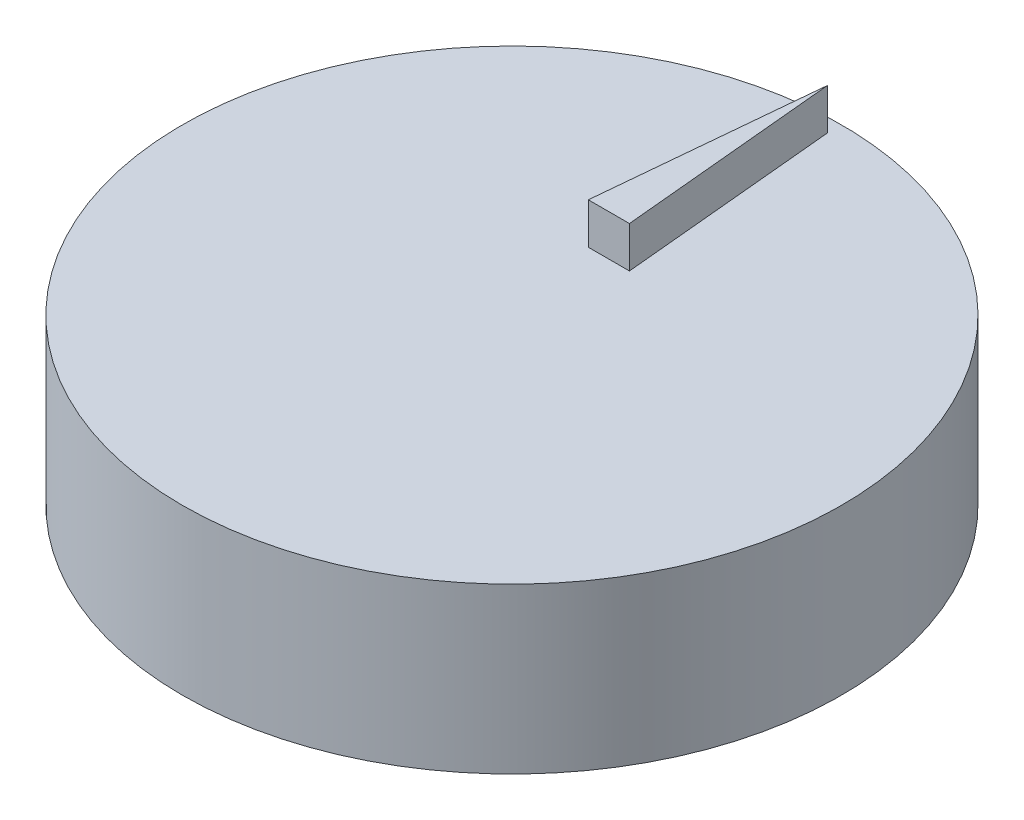
ISO-10303-21;
HEADER;
FILE_DESCRIPTION(('STEP AP214'),'2;1');
FILE_NAME('part.step','',(''),(''),'','','');
FILE_SCHEMA(('AUTOMOTIVE_DESIGN { 1 0 10303 214 1 1 1 1 }'));
ENDSEC;
DATA;
#1=APPLICATION_CONTEXT('core data for automotive mechanical design processes');
#2=APPLICATION_PROTOCOL_DEFINITION('international standard','automotive_design',2000,#1);
#3=PRODUCT_CONTEXT('',#1,'mechanical');
#4=PRODUCT('Part','Part','',(#3));
#5=PRODUCT_RELATED_PRODUCT_CATEGORY('part','',(#4));
#6=PRODUCT_DEFINITION_FORMATION('','',#4);
#7=PRODUCT_DEFINITION_CONTEXT('part definition',#1,'design');
#8=PRODUCT_DEFINITION('design','',#6,#7);
#9=PRODUCT_DEFINITION_SHAPE('','',#8);
#10=(LENGTH_UNIT() NAMED_UNIT(*) SI_UNIT(.MILLI.,.METRE.));
#11=(NAMED_UNIT(*) PLANE_ANGLE_UNIT() SI_UNIT($,.RADIAN.));
#12=(NAMED_UNIT(*) SI_UNIT($,.STERADIAN.) SOLID_ANGLE_UNIT());
#13=UNCERTAINTY_MEASURE_WITH_UNIT(LENGTH_MEASURE(1.E-05),#10,'distance_accuracy_value','');
#14=(GEOMETRIC_REPRESENTATION_CONTEXT(3) GLOBAL_UNCERTAINTY_ASSIGNED_CONTEXT((#13)) GLOBAL_UNIT_ASSIGNED_CONTEXT((#10,
#11,#12)) REPRESENTATION_CONTEXT('',''));
#15=CARTESIAN_POINT('',(0.,0.,0.));
#16=DIRECTION('',(0.,0.,1.));
#17=DIRECTION('',(1.,0.,0.));
#18=AXIS2_PLACEMENT_3D('',#15,#16,#17);
#19=CARTESIAN_POINT('',(0.,20.,-15.));
#20=DIRECTION('',(0.,1.,0.));
#21=DIRECTION('',(0.,0.,1.));
#22=AXIS2_PLACEMENT_3D('',#19,#20,#21);
#23=PLANE('',#22);
#24=CARTESIAN_POINT('',(0.,20.,-15.));
#25=DIRECTION('',(0.,1.,0.));
#26=DIRECTION('',(0.,0.,1.));
#27=AXIS2_PLACEMENT_3D('',#24,#25,#26);
#28=CIRCLE('',#27,40.0812411098952);
#29=CARTESIAN_POINT('',(0.,20.,25.0812411098952));
#30=VERTEX_POINT('',#29);
#31=EDGE_CURVE('E11',#30,#30,#28,.T.);
#32=ORIENTED_EDGE('',*,*,#31,.T.);
#33=EDGE_LOOP('',(#32));
#34=FACE_BOUND('',#33,.T.);
#35=DIRECTION('',(-0.093652210466227,0.,0.995604973608906));
#36=VECTOR('',#35,1.);
#37=CARTESIAN_POINT('',(0.,20.,-53.3674333416405));
#38=LINE('',#37,#36);
#39=CARTESIAN_POINT('',(0.,20.,-53.3674333416405));
#40=VERTEX_POINT('',#39);
#41=CARTESIAN_POINT('',(-2.5,20.,-26.7902450229531));
#42=VERTEX_POINT('',#41);
#43=EDGE_CURVE('E632',#40,#42,#38,.T.);
#44=ORIENTED_EDGE('',*,*,#43,.F.);
#45=DIRECTION('',(-0.0936522104662273,0.,-0.995604973608906));
#46=VECTOR('',#45,1.);
#47=CARTESIAN_POINT('',(2.5,20.,-26.7902450229531));
#48=LINE('',#47,#46);
#49=CARTESIAN_POINT('',(2.5,20.,-26.7902450229531));
#50=VERTEX_POINT('',#49);
#51=EDGE_CURVE('E232',#50,#40,#48,.T.);
#52=ORIENTED_EDGE('',*,*,#51,.F.);
#53=DIRECTION('',(1.,0.,0.));
#54=VECTOR('',#53,1.);
#55=CARTESIAN_POINT('',(-2.5,20.,-26.7902450229531));
#56=LINE('',#55,#54);
#57=EDGE_CURVE('E228',#42,#50,#56,.T.);
#58=ORIENTED_EDGE('',*,*,#57,.F.);
#59=EDGE_LOOP('',(#44,#52,#58));
#60=FACE_BOUND('',#59,.T.);
#61=ADVANCED_FACE('F33',(#34,#60),#23,.T.);
#62=CARTESIAN_POINT('',(0.,0.,-15.));
#63=DIRECTION('',(0.,1.,0.));
#64=DIRECTION('',(0.,0.,1.));
#65=AXIS2_PLACEMENT_3D('',#62,#63,#64);
#66=PLANE('',#65);
#67=DIRECTION('',(0.,0.,1.));
#68=VECTOR('',#67,1.);
#69=CARTESIAN_POINT('',(-2.5000000000001,0.,-18.));
#70=LINE('',#69,#68);
#71=CARTESIAN_POINT('',(-2.5000000000001,0.,-18.));
#72=VERTEX_POINT('',#71);
#73=CARTESIAN_POINT('',(-2.5000000000001,0.,-15.));
#74=VERTEX_POINT('',#73);
#75=EDGE_CURVE('E266',#72,#74,#70,.T.);
#76=ORIENTED_EDGE('',*,*,#75,.T.);
#77=DIRECTION('',(1.,0.,0.));
#78=VECTOR('',#77,1.);
#79=CARTESIAN_POINT('',(-2.5000000000001,0.,-15.));
#80=LINE('',#79,#78);
#81=CARTESIAN_POINT('',(2.4999999999999,0.,-15.));
#82=VERTEX_POINT('',#81);
#83=EDGE_CURVE('E280',#74,#82,#80,.T.);
#84=ORIENTED_EDGE('',*,*,#83,.T.);
#85=DIRECTION('',(0.,0.,-1.));
#86=VECTOR('',#85,1.);
#87=CARTESIAN_POINT('',(2.4999999999999,0.,-18.));
#88=LINE('',#87,#86);
#89=CARTESIAN_POINT('',(2.4999999999999,0.,-18.));
#90=VERTEX_POINT('',#89);
#91=EDGE_CURVE('E283',#82,#90,#88,.T.);
#92=ORIENTED_EDGE('',*,*,#91,.T.);
#93=DIRECTION('',(-1.,0.,0.));
#94=VECTOR('',#93,1.);
#95=CARTESIAN_POINT('',(-2.5000000000001,0.,-18.));
#96=LINE('',#95,#94);
#97=EDGE_CURVE('E271',#90,#72,#96,.T.);
#98=ORIENTED_EDGE('',*,*,#97,.T.);
#99=EDGE_LOOP('',(#76,#84,#92,#98));
#100=FACE_BOUND('',#99,.T.);
#101=DIRECTION('',(0.,0.,1.));
#102=VECTOR('',#101,1.);
#103=CARTESIAN_POINT('',(-2.50000000000005,0.,-4.));
#104=LINE('',#103,#102);
#105=CARTESIAN_POINT('',(-2.50000000000005,0.,-4.));
#106=VERTEX_POINT('',#105);
#107=CARTESIAN_POINT('',(-2.50000000000005,0.,-0.999999999999999));
#108=VERTEX_POINT('',#107);
#109=EDGE_CURVE('E328',#106,#108,#104,.T.);
#110=ORIENTED_EDGE('',*,*,#109,.T.);
#111=DIRECTION('',(1.,0.,0.));
#112=VECTOR('',#111,1.);
#113=CARTESIAN_POINT('',(-2.50000000000005,0.,-0.999999999999999));
#114=LINE('',#113,#112);
#115=CARTESIAN_POINT('',(2.49999999999995,0.,-0.999999999999999));
#116=VERTEX_POINT('',#115);
#117=EDGE_CURVE('E342',#108,#116,#114,.T.);
#118=ORIENTED_EDGE('',*,*,#117,.T.);
#119=DIRECTION('',(0.,0.,-1.));
#120=VECTOR('',#119,1.);
#121=CARTESIAN_POINT('',(2.49999999999995,0.,-4.));
#122=LINE('',#121,#120);
#123=CARTESIAN_POINT('',(2.49999999999995,0.,-4.));
#124=VERTEX_POINT('',#123);
#125=EDGE_CURVE('E345',#116,#124,#122,.T.);
#126=ORIENTED_EDGE('',*,*,#125,.T.);
#127=DIRECTION('',(-1.,0.,0.));
#128=VECTOR('',#127,1.);
#129=CARTESIAN_POINT('',(-2.50000000000005,0.,-4.));
#130=LINE('',#129,#128);
#131=EDGE_CURVE('E333',#124,#106,#130,.T.);
#132=ORIENTED_EDGE('',*,*,#131,.T.);
#133=EDGE_LOOP('',(#110,#118,#126,#132));
#134=FACE_BOUND('',#133,.T.);
#135=DIRECTION('',(0.,0.,1.));
#136=VECTOR('',#135,1.);
#137=CARTESIAN_POINT('',(-2.5,0.,10.));
#138=LINE('',#137,#136);
#139=CARTESIAN_POINT('',(-2.5,0.,10.));
#140=VERTEX_POINT('',#139);
#141=CARTESIAN_POINT('',(-2.5,0.,13.));
#142=VERTEX_POINT('',#141);
#143=EDGE_CURVE('E390',#140,#142,#138,.T.);
#144=ORIENTED_EDGE('',*,*,#143,.T.);
#145=DIRECTION('',(1.,0.,0.));
#146=VECTOR('',#145,1.);
#147=CARTESIAN_POINT('',(-2.5,0.,13.));
#148=LINE('',#147,#146);
#149=CARTESIAN_POINT('',(2.5,0.,13.));
#150=VERTEX_POINT('',#149);
#151=EDGE_CURVE('E404',#142,#150,#148,.T.);
#152=ORIENTED_EDGE('',*,*,#151,.T.);
#153=DIRECTION('',(0.,0.,-1.));
#154=VECTOR('',#153,1.);
#155=CARTESIAN_POINT('',(2.5,0.,10.));
#156=LINE('',#155,#154);
#157=CARTESIAN_POINT('',(2.5,0.,10.));
#158=VERTEX_POINT('',#157);
#159=EDGE_CURVE('E407',#150,#158,#156,.T.);
#160=ORIENTED_EDGE('',*,*,#159,.T.);
#161=DIRECTION('',(-1.,0.,0.));
#162=VECTOR('',#161,1.);
#163=CARTESIAN_POINT('',(-2.5,0.,10.));
#164=LINE('',#163,#162);
#165=EDGE_CURVE('E395',#158,#140,#164,.T.);
#166=ORIENTED_EDGE('',*,*,#165,.T.);
#167=EDGE_LOOP('',(#144,#152,#160,#166));
#168=FACE_BOUND('',#167,.T.);
#169=CARTESIAN_POINT('',(0.,0.,-15.));
#170=DIRECTION('',(0.,1.,0.));
#171=DIRECTION('',(0.,0.,1.));
#172=AXIS2_PLACEMENT_3D('',#169,#170,#171);
#173=CIRCLE('',#172,40.0812411098952);
#174=CARTESIAN_POINT('',(0.,0.,25.0812411098952));
#175=VERTEX_POINT('',#174);
#176=EDGE_CURVE('E37',#175,#175,#173,.T.);
#177=ORIENTED_EDGE('',*,*,#176,.F.);
#178=EDGE_LOOP('',(#177));
#179=FACE_BOUND('',#178,.T.);
#180=DIRECTION('',(0.,0.,1.));
#181=VECTOR('',#180,1.);
#182=CARTESIAN_POINT('',(-2.50000000000002,0.,3.));
#183=LINE('',#182,#181);
#184=CARTESIAN_POINT('',(-2.50000000000002,0.,3.));
#185=VERTEX_POINT('',#184);
#186=CARTESIAN_POINT('',(-2.50000000000002,0.,6.));
#187=VERTEX_POINT('',#186);
#188=EDGE_CURVE('E359',#185,#187,#183,.T.);
#189=ORIENTED_EDGE('',*,*,#188,.T.);
#190=DIRECTION('',(1.,0.,0.));
#191=VECTOR('',#190,1.);
#192=CARTESIAN_POINT('',(-2.50000000000002,0.,6.));
#193=LINE('',#192,#191);
#194=CARTESIAN_POINT('',(2.49999999999998,0.,6.));
#195=VERTEX_POINT('',#194);
#196=EDGE_CURVE('E373',#187,#195,#193,.T.);
#197=ORIENTED_EDGE('',*,*,#196,.T.);
#198=DIRECTION('',(0.,0.,-1.));
#199=VECTOR('',#198,1.);
#200=CARTESIAN_POINT('',(2.49999999999998,0.,3.));
#201=LINE('',#200,#199);
#202=CARTESIAN_POINT('',(2.49999999999998,0.,3.));
#203=VERTEX_POINT('',#202);
#204=EDGE_CURVE('E376',#195,#203,#201,.T.);
#205=ORIENTED_EDGE('',*,*,#204,.T.);
#206=DIRECTION('',(-1.,0.,0.));
#207=VECTOR('',#206,1.);
#208=CARTESIAN_POINT('',(-2.50000000000002,0.,3.));
#209=LINE('',#208,#207);
#210=EDGE_CURVE('E364',#203,#185,#209,.T.);
#211=ORIENTED_EDGE('',*,*,#210,.T.);
#212=EDGE_LOOP('',(#189,#197,#205,#211));
#213=FACE_BOUND('',#212,.T.);
#214=DIRECTION('',(0.,0.,1.));
#215=VECTOR('',#214,1.);
#216=CARTESIAN_POINT('',(-2.50000000000007,0.,-11.));
#217=LINE('',#216,#215);
#218=CARTESIAN_POINT('',(-2.50000000000007,0.,-11.));
#219=VERTEX_POINT('',#218);
#220=CARTESIAN_POINT('',(-2.50000000000007,0.,-8.));
#221=VERTEX_POINT('',#220);
#222=EDGE_CURVE('E297',#219,#221,#217,.T.);
#223=ORIENTED_EDGE('',*,*,#222,.T.);
#224=DIRECTION('',(1.,0.,0.));
#225=VECTOR('',#224,1.);
#226=CARTESIAN_POINT('',(-2.50000000000007,0.,-8.));
#227=LINE('',#226,#225);
#228=CARTESIAN_POINT('',(2.49999999999993,0.,-8.));
#229=VERTEX_POINT('',#228);
#230=EDGE_CURVE('E311',#221,#229,#227,.T.);
#231=ORIENTED_EDGE('',*,*,#230,.T.);
#232=DIRECTION('',(0.,0.,-1.));
#233=VECTOR('',#232,1.);
#234=CARTESIAN_POINT('',(2.49999999999993,0.,-11.));
#235=LINE('',#234,#233);
#236=CARTESIAN_POINT('',(2.49999999999993,0.,-11.));
#237=VERTEX_POINT('',#236);
#238=EDGE_CURVE('E314',#229,#237,#235,.T.);
#239=ORIENTED_EDGE('',*,*,#238,.T.);
#240=DIRECTION('',(-1.,0.,0.));
#241=VECTOR('',#240,1.);
#242=CARTESIAN_POINT('',(-2.50000000000007,0.,-11.));
#243=LINE('',#242,#241);
#244=EDGE_CURVE('E302',#237,#219,#243,.T.);
#245=ORIENTED_EDGE('',*,*,#244,.T.);
#246=EDGE_LOOP('',(#223,#231,#239,#245));
#247=FACE_BOUND('',#246,.T.);
#248=DIRECTION('',(0.,0.,1.));
#249=VECTOR('',#248,1.);
#250=CARTESIAN_POINT('',(-2.50000000000012,0.,-25.));
#251=LINE('',#250,#249);
#252=CARTESIAN_POINT('',(-2.50000000000012,0.,-25.));
#253=VERTEX_POINT('',#252);
#254=CARTESIAN_POINT('',(-2.50000000000012,0.,-22.));
#255=VERTEX_POINT('',#254);
#256=EDGE_CURVE('E56',#253,#255,#251,.T.);
#257=ORIENTED_EDGE('',*,*,#256,.T.);
#258=DIRECTION('',(1.,0.,0.));
#259=VECTOR('',#258,1.);
#260=CARTESIAN_POINT('',(-2.50000000000012,0.,-22.));
#261=LINE('',#260,#259);
#262=CARTESIAN_POINT('',(2.49999999999988,0.,-22.));
#263=VERTEX_POINT('',#262);
#264=EDGE_CURVE('E235',#255,#263,#261,.T.);
#265=ORIENTED_EDGE('',*,*,#264,.T.);
#266=DIRECTION('',(0.,0.,-1.));
#267=VECTOR('',#266,1.);
#268=CARTESIAN_POINT('',(2.49999999999988,0.,-25.));
#269=LINE('',#268,#267);
#270=CARTESIAN_POINT('',(2.49999999999988,0.,-25.));
#271=VERTEX_POINT('',#270);
#272=EDGE_CURVE('E254',#263,#271,#269,.T.);
#273=ORIENTED_EDGE('',*,*,#272,.T.);
#274=DIRECTION('',(-1.,0.,0.));
#275=VECTOR('',#274,1.);
#276=CARTESIAN_POINT('',(-2.50000000000012,0.,-25.));
#277=LINE('',#276,#275);
#278=EDGE_CURVE('E245',#271,#253,#277,.T.);
#279=ORIENTED_EDGE('',*,*,#278,.T.);
#280=EDGE_LOOP('',(#257,#265,#273,#279));
#281=FACE_BOUND('',#280,.T.);
#282=ADVANCED_FACE('F426',(#100,#134,#168,#179,#213,#247,#281),#66,.F.);
#283=CARTESIAN_POINT('',(0.,20.,-15.));
#284=DIRECTION('',(0.,-1.,0.));
#285=DIRECTION('',(0.,0.,-1.));
#286=AXIS2_PLACEMENT_3D('',#283,#284,#285);
#287=CYLINDRICAL_SURFACE('',#286,40.0812411098952);
#288=ORIENTED_EDGE('',*,*,#31,.F.);
#289=EDGE_LOOP('',(#288));
#290=FACE_BOUND('',#289,.T.);
#291=ORIENTED_EDGE('',*,*,#176,.T.);
#292=EDGE_LOOP('',(#291));
#293=FACE_BOUND('',#292,.T.);
#294=ADVANCED_FACE('F35',(#290,#293),#287,.T.);
#295=CARTESIAN_POINT('',(-2.5,8.,10.));
#296=DIRECTION('',(1.,0.,0.));
#297=DIRECTION('',(0.,0.,-1.));
#298=AXIS2_PLACEMENT_3D('',#295,#296,#297);
#299=PLANE('',#298);
#300=ORIENTED_EDGE('',*,*,#143,.F.);
#301=DIRECTION('',(0.,-1.,0.));
#302=VECTOR('',#301,1.);
#303=CARTESIAN_POINT('',(-2.5,8.,10.));
#304=LINE('',#303,#302);
#305=CARTESIAN_POINT('',(-2.5,8.,10.));
#306=VERTEX_POINT('',#305);
#307=EDGE_CURVE('E401',#306,#140,#304,.T.);
#308=ORIENTED_EDGE('',*,*,#307,.F.);
#309=DIRECTION('',(0.,0.,1.));
#310=VECTOR('',#309,1.);
#311=CARTESIAN_POINT('',(-2.5,8.,10.));
#312=LINE('',#311,#310);
#313=CARTESIAN_POINT('',(-2.5,8.,13.));
#314=VERTEX_POINT('',#313);
#315=EDGE_CURVE('E391',#306,#314,#312,.T.);
#316=ORIENTED_EDGE('',*,*,#315,.T.);
#317=DIRECTION('',(0.,-1.,0.));
#318=VECTOR('',#317,1.);
#319=CARTESIAN_POINT('',(-2.5,8.,13.));
#320=LINE('',#319,#318);
#321=EDGE_CURVE('E418',#314,#142,#320,.T.);
#322=ORIENTED_EDGE('',*,*,#321,.T.);
#323=EDGE_LOOP('',(#300,#308,#316,#322));
#324=FACE_BOUND('',#323,.T.);
#325=ADVANCED_FACE('F464',(#324),#299,.T.);
#326=CARTESIAN_POINT('',(-2.5,8.,13.));
#327=DIRECTION('',(0.,0.,-1.));
#328=DIRECTION('',(-1.,0.,0.));
#329=AXIS2_PLACEMENT_3D('',#326,#327,#328);
#330=PLANE('',#329);
#331=ORIENTED_EDGE('',*,*,#151,.F.);
#332=ORIENTED_EDGE('',*,*,#321,.F.);
#333=DIRECTION('',(1.,0.,0.));
#334=VECTOR('',#333,1.);
#335=CARTESIAN_POINT('',(-2.5,8.,13.));
#336=LINE('',#335,#334);
#337=CARTESIAN_POINT('',(2.5,8.,13.));
#338=VERTEX_POINT('',#337);
#339=EDGE_CURVE('E394',#314,#338,#336,.T.);
#340=ORIENTED_EDGE('',*,*,#339,.T.);
#341=DIRECTION('',(0.,-1.,0.));
#342=VECTOR('',#341,1.);
#343=CARTESIAN_POINT('',(2.5,8.,13.));
#344=LINE('',#343,#342);
#345=EDGE_CURVE('E416',#338,#150,#344,.T.);
#346=ORIENTED_EDGE('',*,*,#345,.T.);
#347=EDGE_LOOP('',(#331,#332,#340,#346));
#348=FACE_BOUND('',#347,.T.);
#349=ADVANCED_FACE('F467',(#348),#330,.T.);
#350=CARTESIAN_POINT('',(2.5,8.,10.));
#351=DIRECTION('',(-1.,0.,0.));
#352=DIRECTION('',(0.,0.,1.));
#353=AXIS2_PLACEMENT_3D('',#350,#351,#352);
#354=PLANE('',#353);
#355=ORIENTED_EDGE('',*,*,#159,.F.);
#356=ORIENTED_EDGE('',*,*,#345,.F.);
#357=DIRECTION('',(0.,0.,-1.));
#358=VECTOR('',#357,1.);
#359=CARTESIAN_POINT('',(2.5,8.,10.));
#360=LINE('',#359,#358);
#361=CARTESIAN_POINT('',(2.5,8.,10.));
#362=VERTEX_POINT('',#361);
#363=EDGE_CURVE('E397',#338,#362,#360,.T.);
#364=ORIENTED_EDGE('',*,*,#363,.T.);
#365=DIRECTION('',(0.,-1.,0.));
#366=VECTOR('',#365,1.);
#367=CARTESIAN_POINT('',(2.5,8.,10.));
#368=LINE('',#367,#366);
#369=EDGE_CURVE('E414',#362,#158,#368,.T.);
#370=ORIENTED_EDGE('',*,*,#369,.T.);
#371=EDGE_LOOP('',(#355,#356,#364,#370));
#372=FACE_BOUND('',#371,.T.);
#373=ADVANCED_FACE('F470',(#372),#354,.T.);
#374=CARTESIAN_POINT('',(-2.5,8.,10.));
#375=DIRECTION('',(0.,0.,1.));
#376=DIRECTION('',(1.,0.,0.));
#377=AXIS2_PLACEMENT_3D('',#374,#375,#376);
#378=PLANE('',#377);
#379=ORIENTED_EDGE('',*,*,#165,.F.);
#380=ORIENTED_EDGE('',*,*,#369,.F.);
#381=DIRECTION('',(-1.,0.,0.));
#382=VECTOR('',#381,1.);
#383=CARTESIAN_POINT('',(-2.5,8.,10.));
#384=LINE('',#383,#382);
#385=EDGE_CURVE('E399',#362,#306,#384,.T.);
#386=ORIENTED_EDGE('',*,*,#385,.T.);
#387=ORIENTED_EDGE('',*,*,#307,.T.);
#388=EDGE_LOOP('',(#379,#380,#386,#387));
#389=FACE_BOUND('',#388,.T.);
#390=ADVANCED_FACE('F474',(#389),#378,.T.);
#391=CARTESIAN_POINT('',(0.,8.,0.));
#392=DIRECTION('',(0.,1.,0.));
#393=DIRECTION('',(0.,0.,1.));
#394=AXIS2_PLACEMENT_3D('',#391,#392,#393);
#395=PLANE('',#394);
#396=ORIENTED_EDGE('',*,*,#315,.F.);
#397=ORIENTED_EDGE('',*,*,#385,.F.);
#398=ORIENTED_EDGE('',*,*,#363,.F.);
#399=ORIENTED_EDGE('',*,*,#339,.F.);
#400=EDGE_LOOP('',(#396,#397,#398,#399));
#401=FACE_BOUND('',#400,.T.);
#402=ADVANCED_FACE('F478',(#401),#395,.F.);
#403=CARTESIAN_POINT('',(-2.50000000000002,8.,3.));
#404=DIRECTION('',(1.,0.,0.));
#405=DIRECTION('',(0.,0.,-1.));
#406=AXIS2_PLACEMENT_3D('',#403,#404,#405);
#407=PLANE('',#406);
#408=ORIENTED_EDGE('',*,*,#188,.F.);
#409=DIRECTION('',(0.,-1.,0.));
#410=VECTOR('',#409,1.);
#411=CARTESIAN_POINT('',(-2.50000000000002,8.,3.));
#412=LINE('',#411,#410);
#413=CARTESIAN_POINT('',(-2.50000000000002,8.,3.));
#414=VERTEX_POINT('',#413);
#415=EDGE_CURVE('E370',#414,#185,#412,.T.);
#416=ORIENTED_EDGE('',*,*,#415,.F.);
#417=DIRECTION('',(0.,0.,1.));
#418=VECTOR('',#417,1.);
#419=CARTESIAN_POINT('',(-2.50000000000002,8.,3.));
#420=LINE('',#419,#418);
#421=CARTESIAN_POINT('',(-2.50000000000002,8.,6.));
#422=VERTEX_POINT('',#421);
#423=EDGE_CURVE('E360',#414,#422,#420,.T.);
#424=ORIENTED_EDGE('',*,*,#423,.T.);
#425=DIRECTION('',(0.,-1.,0.));
#426=VECTOR('',#425,1.);
#427=CARTESIAN_POINT('',(-2.50000000000002,8.,6.));
#428=LINE('',#427,#426);
#429=EDGE_CURVE('E387',#422,#187,#428,.T.);
#430=ORIENTED_EDGE('',*,*,#429,.T.);
#431=EDGE_LOOP('',(#408,#416,#424,#430));
#432=FACE_BOUND('',#431,.T.);
#433=ADVANCED_FACE('F482',(#432),#407,.T.);
#434=CARTESIAN_POINT('',(-2.50000000000002,8.,6.));
#435=DIRECTION('',(0.,0.,-1.));
#436=DIRECTION('',(-1.,0.,0.));
#437=AXIS2_PLACEMENT_3D('',#434,#435,#436);
#438=PLANE('',#437);
#439=ORIENTED_EDGE('',*,*,#196,.F.);
#440=ORIENTED_EDGE('',*,*,#429,.F.);
#441=DIRECTION('',(1.,0.,0.));
#442=VECTOR('',#441,1.);
#443=CARTESIAN_POINT('',(-2.50000000000002,8.,6.));
#444=LINE('',#443,#442);
#445=CARTESIAN_POINT('',(2.49999999999998,8.,6.));
#446=VERTEX_POINT('',#445);
#447=EDGE_CURVE('E363',#422,#446,#444,.T.);
#448=ORIENTED_EDGE('',*,*,#447,.T.);
#449=DIRECTION('',(0.,-1.,0.));
#450=VECTOR('',#449,1.);
#451=CARTESIAN_POINT('',(2.49999999999998,8.,6.));
#452=LINE('',#451,#450);
#453=EDGE_CURVE('E385',#446,#195,#452,.T.);
#454=ORIENTED_EDGE('',*,*,#453,.T.);
#455=EDGE_LOOP('',(#439,#440,#448,#454));
#456=FACE_BOUND('',#455,.T.);
#457=ADVANCED_FACE('F486',(#456),#438,.T.);
#458=CARTESIAN_POINT('',(2.49999999999998,8.,3.));
#459=DIRECTION('',(-1.,0.,0.));
#460=DIRECTION('',(0.,0.,1.));
#461=AXIS2_PLACEMENT_3D('',#458,#459,#460);
#462=PLANE('',#461);
#463=ORIENTED_EDGE('',*,*,#204,.F.);
#464=ORIENTED_EDGE('',*,*,#453,.F.);
#465=DIRECTION('',(0.,0.,-1.));
#466=VECTOR('',#465,1.);
#467=CARTESIAN_POINT('',(2.49999999999998,8.,3.));
#468=LINE('',#467,#466);
#469=CARTESIAN_POINT('',(2.49999999999998,8.,3.));
#470=VERTEX_POINT('',#469);
#471=EDGE_CURVE('E366',#446,#470,#468,.T.);
#472=ORIENTED_EDGE('',*,*,#471,.T.);
#473=DIRECTION('',(0.,-1.,0.));
#474=VECTOR('',#473,1.);
#475=CARTESIAN_POINT('',(2.49999999999998,8.,3.));
#476=LINE('',#475,#474);
#477=EDGE_CURVE('E383',#470,#203,#476,.T.);
#478=ORIENTED_EDGE('',*,*,#477,.T.);
#479=EDGE_LOOP('',(#463,#464,#472,#478));
#480=FACE_BOUND('',#479,.T.);
#481=ADVANCED_FACE('F490',(#480),#462,.T.);
#482=CARTESIAN_POINT('',(-2.50000000000002,8.,3.));
#483=DIRECTION('',(0.,0.,1.));
#484=DIRECTION('',(1.,0.,0.));
#485=AXIS2_PLACEMENT_3D('',#482,#483,#484);
#486=PLANE('',#485);
#487=ORIENTED_EDGE('',*,*,#210,.F.);
#488=ORIENTED_EDGE('',*,*,#477,.F.);
#489=DIRECTION('',(-1.,0.,0.));
#490=VECTOR('',#489,1.);
#491=CARTESIAN_POINT('',(-2.50000000000002,8.,3.));
#492=LINE('',#491,#490);
#493=EDGE_CURVE('E368',#470,#414,#492,.T.);
#494=ORIENTED_EDGE('',*,*,#493,.T.);
#495=ORIENTED_EDGE('',*,*,#415,.T.);
#496=EDGE_LOOP('',(#487,#488,#494,#495));
#497=FACE_BOUND('',#496,.T.);
#498=ADVANCED_FACE('F494',(#497),#486,.T.);
#499=CARTESIAN_POINT('',(0.,8.,0.));
#500=DIRECTION('',(0.,1.,0.));
#501=DIRECTION('',(0.,0.,1.));
#502=AXIS2_PLACEMENT_3D('',#499,#500,#501);
#503=PLANE('',#502);
#504=ORIENTED_EDGE('',*,*,#423,.F.);
#505=ORIENTED_EDGE('',*,*,#493,.F.);
#506=ORIENTED_EDGE('',*,*,#471,.F.);
#507=ORIENTED_EDGE('',*,*,#447,.F.);
#508=EDGE_LOOP('',(#504,#505,#506,#507));
#509=FACE_BOUND('',#508,.T.);
#510=ADVANCED_FACE('F498',(#509),#503,.F.);
#511=CARTESIAN_POINT('',(-2.50000000000005,8.,-4.));
#512=DIRECTION('',(1.,0.,0.));
#513=DIRECTION('',(0.,0.,-1.));
#514=AXIS2_PLACEMENT_3D('',#511,#512,#513);
#515=PLANE('',#514);
#516=ORIENTED_EDGE('',*,*,#109,.F.);
#517=DIRECTION('',(0.,-1.,0.));
#518=VECTOR('',#517,1.);
#519=CARTESIAN_POINT('',(-2.50000000000005,8.,-4.));
#520=LINE('',#519,#518);
#521=CARTESIAN_POINT('',(-2.50000000000005,8.,-4.));
#522=VERTEX_POINT('',#521);
#523=EDGE_CURVE('E339',#522,#106,#520,.T.);
#524=ORIENTED_EDGE('',*,*,#523,.F.);
#525=DIRECTION('',(0.,0.,1.));
#526=VECTOR('',#525,1.);
#527=CARTESIAN_POINT('',(-2.50000000000005,8.,-4.));
#528=LINE('',#527,#526);
#529=CARTESIAN_POINT('',(-2.50000000000005,8.,-0.999999999999999));
#530=VERTEX_POINT('',#529);
#531=EDGE_CURVE('E329',#522,#530,#528,.T.);
#532=ORIENTED_EDGE('',*,*,#531,.T.);
#533=DIRECTION('',(0.,-1.,0.));
#534=VECTOR('',#533,1.);
#535=CARTESIAN_POINT('',(-2.50000000000005,8.,-0.999999999999999));
#536=LINE('',#535,#534);
#537=EDGE_CURVE('E356',#530,#108,#536,.T.);
#538=ORIENTED_EDGE('',*,*,#537,.T.);
#539=EDGE_LOOP('',(#516,#524,#532,#538));
#540=FACE_BOUND('',#539,.T.);
#541=ADVANCED_FACE('F502',(#540),#515,.T.);
#542=CARTESIAN_POINT('',(-2.50000000000005,8.,-0.999999999999999));
#543=DIRECTION('',(0.,0.,-1.));
#544=DIRECTION('',(-1.,0.,0.));
#545=AXIS2_PLACEMENT_3D('',#542,#543,#544);
#546=PLANE('',#545);
#547=ORIENTED_EDGE('',*,*,#117,.F.);
#548=ORIENTED_EDGE('',*,*,#537,.F.);
#549=DIRECTION('',(1.,0.,0.));
#550=VECTOR('',#549,1.);
#551=CARTESIAN_POINT('',(-2.50000000000005,8.,-0.999999999999999));
#552=LINE('',#551,#550);
#553=CARTESIAN_POINT('',(2.49999999999995,8.,-0.999999999999999));
#554=VERTEX_POINT('',#553);
#555=EDGE_CURVE('E332',#530,#554,#552,.T.);
#556=ORIENTED_EDGE('',*,*,#555,.T.);
#557=DIRECTION('',(0.,-1.,0.));
#558=VECTOR('',#557,1.);
#559=CARTESIAN_POINT('',(2.49999999999995,8.,-0.999999999999999));
#560=LINE('',#559,#558);
#561=EDGE_CURVE('E354',#554,#116,#560,.T.);
#562=ORIENTED_EDGE('',*,*,#561,.T.);
#563=EDGE_LOOP('',(#547,#548,#556,#562));
#564=FACE_BOUND('',#563,.T.);
#565=ADVANCED_FACE('F506',(#564),#546,.T.);
#566=CARTESIAN_POINT('',(2.49999999999995,8.,-4.));
#567=DIRECTION('',(-1.,0.,0.));
#568=DIRECTION('',(0.,0.,1.));
#569=AXIS2_PLACEMENT_3D('',#566,#567,#568);
#570=PLANE('',#569);
#571=ORIENTED_EDGE('',*,*,#125,.F.);
#572=ORIENTED_EDGE('',*,*,#561,.F.);
#573=DIRECTION('',(0.,0.,-1.));
#574=VECTOR('',#573,1.);
#575=CARTESIAN_POINT('',(2.49999999999995,8.,-4.));
#576=LINE('',#575,#574);
#577=CARTESIAN_POINT('',(2.49999999999995,8.,-4.));
#578=VERTEX_POINT('',#577);
#579=EDGE_CURVE('E335',#554,#578,#576,.T.);
#580=ORIENTED_EDGE('',*,*,#579,.T.);
#581=DIRECTION('',(0.,-1.,0.));
#582=VECTOR('',#581,1.);
#583=CARTESIAN_POINT('',(2.49999999999995,8.,-4.));
#584=LINE('',#583,#582);
#585=EDGE_CURVE('E352',#578,#124,#584,.T.);
#586=ORIENTED_EDGE('',*,*,#585,.T.);
#587=EDGE_LOOP('',(#571,#572,#580,#586));
#588=FACE_BOUND('',#587,.T.);
#589=ADVANCED_FACE('F510',(#588),#570,.T.);
#590=CARTESIAN_POINT('',(-2.50000000000005,8.,-4.));
#591=DIRECTION('',(0.,0.,1.));
#592=DIRECTION('',(1.,0.,0.));
#593=AXIS2_PLACEMENT_3D('',#590,#591,#592);
#594=PLANE('',#593);
#595=ORIENTED_EDGE('',*,*,#131,.F.);
#596=ORIENTED_EDGE('',*,*,#585,.F.);
#597=DIRECTION('',(-1.,0.,0.));
#598=VECTOR('',#597,1.);
#599=CARTESIAN_POINT('',(-2.50000000000005,8.,-4.));
#600=LINE('',#599,#598);
#601=EDGE_CURVE('E337',#578,#522,#600,.T.);
#602=ORIENTED_EDGE('',*,*,#601,.T.);
#603=ORIENTED_EDGE('',*,*,#523,.T.);
#604=EDGE_LOOP('',(#595,#596,#602,#603));
#605=FACE_BOUND('',#604,.T.);
#606=ADVANCED_FACE('F514',(#605),#594,.T.);
#607=CARTESIAN_POINT('',(0.,8.,0.));
#608=DIRECTION('',(0.,1.,0.));
#609=DIRECTION('',(0.,0.,1.));
#610=AXIS2_PLACEMENT_3D('',#607,#608,#609);
#611=PLANE('',#610);
#612=ORIENTED_EDGE('',*,*,#531,.F.);
#613=ORIENTED_EDGE('',*,*,#601,.F.);
#614=ORIENTED_EDGE('',*,*,#579,.F.);
#615=ORIENTED_EDGE('',*,*,#555,.F.);
#616=EDGE_LOOP('',(#612,#613,#614,#615));
#617=FACE_BOUND('',#616,.T.);
#618=ADVANCED_FACE('F518',(#617),#611,.F.);
#619=CARTESIAN_POINT('',(-2.50000000000007,8.,-11.));
#620=DIRECTION('',(1.,0.,0.));
#621=DIRECTION('',(0.,0.,-1.));
#622=AXIS2_PLACEMENT_3D('',#619,#620,#621);
#623=PLANE('',#622);
#624=ORIENTED_EDGE('',*,*,#222,.F.);
#625=DIRECTION('',(0.,-1.,0.));
#626=VECTOR('',#625,1.);
#627=CARTESIAN_POINT('',(-2.50000000000007,8.,-11.));
#628=LINE('',#627,#626);
#629=CARTESIAN_POINT('',(-2.50000000000007,8.,-11.));
#630=VERTEX_POINT('',#629);
#631=EDGE_CURVE('E308',#630,#219,#628,.T.);
#632=ORIENTED_EDGE('',*,*,#631,.F.);
#633=DIRECTION('',(0.,0.,1.));
#634=VECTOR('',#633,1.);
#635=CARTESIAN_POINT('',(-2.50000000000007,8.,-11.));
#636=LINE('',#635,#634);
#637=CARTESIAN_POINT('',(-2.50000000000007,8.,-8.));
#638=VERTEX_POINT('',#637);
#639=EDGE_CURVE('E298',#630,#638,#636,.T.);
#640=ORIENTED_EDGE('',*,*,#639,.T.);
#641=DIRECTION('',(0.,-1.,0.));
#642=VECTOR('',#641,1.);
#643=CARTESIAN_POINT('',(-2.50000000000007,8.,-8.));
#644=LINE('',#643,#642);
#645=EDGE_CURVE('E325',#638,#221,#644,.T.);
#646=ORIENTED_EDGE('',*,*,#645,.T.);
#647=EDGE_LOOP('',(#624,#632,#640,#646));
#648=FACE_BOUND('',#647,.T.);
#649=ADVANCED_FACE('F522',(#648),#623,.T.);
#650=CARTESIAN_POINT('',(-2.50000000000007,8.,-8.));
#651=DIRECTION('',(0.,0.,-1.));
#652=DIRECTION('',(-1.,0.,0.));
#653=AXIS2_PLACEMENT_3D('',#650,#651,#652);
#654=PLANE('',#653);
#655=ORIENTED_EDGE('',*,*,#230,.F.);
#656=ORIENTED_EDGE('',*,*,#645,.F.);
#657=DIRECTION('',(1.,0.,0.));
#658=VECTOR('',#657,1.);
#659=CARTESIAN_POINT('',(-2.50000000000007,8.,-8.));
#660=LINE('',#659,#658);
#661=CARTESIAN_POINT('',(2.49999999999993,8.,-8.));
#662=VERTEX_POINT('',#661);
#663=EDGE_CURVE('E301',#638,#662,#660,.T.);
#664=ORIENTED_EDGE('',*,*,#663,.T.);
#665=DIRECTION('',(0.,-1.,0.));
#666=VECTOR('',#665,1.);
#667=CARTESIAN_POINT('',(2.49999999999993,8.,-8.));
#668=LINE('',#667,#666);
#669=EDGE_CURVE('E323',#662,#229,#668,.T.);
#670=ORIENTED_EDGE('',*,*,#669,.T.);
#671=EDGE_LOOP('',(#655,#656,#664,#670));
#672=FACE_BOUND('',#671,.T.);
#673=ADVANCED_FACE('F526',(#672),#654,.T.);
#674=CARTESIAN_POINT('',(2.49999999999993,8.,-11.));
#675=DIRECTION('',(-1.,0.,0.));
#676=DIRECTION('',(0.,0.,1.));
#677=AXIS2_PLACEMENT_3D('',#674,#675,#676);
#678=PLANE('',#677);
#679=ORIENTED_EDGE('',*,*,#238,.F.);
#680=ORIENTED_EDGE('',*,*,#669,.F.);
#681=DIRECTION('',(0.,0.,-1.));
#682=VECTOR('',#681,1.);
#683=CARTESIAN_POINT('',(2.49999999999993,8.,-11.));
#684=LINE('',#683,#682);
#685=CARTESIAN_POINT('',(2.49999999999993,8.,-11.));
#686=VERTEX_POINT('',#685);
#687=EDGE_CURVE('E304',#662,#686,#684,.T.);
#688=ORIENTED_EDGE('',*,*,#687,.T.);
#689=DIRECTION('',(0.,-1.,0.));
#690=VECTOR('',#689,1.);
#691=CARTESIAN_POINT('',(2.49999999999993,8.,-11.));
#692=LINE('',#691,#690);
#693=EDGE_CURVE('E321',#686,#237,#692,.T.);
#694=ORIENTED_EDGE('',*,*,#693,.T.);
#695=EDGE_LOOP('',(#679,#680,#688,#694));
#696=FACE_BOUND('',#695,.T.);
#697=ADVANCED_FACE('F530',(#696),#678,.T.);
#698=CARTESIAN_POINT('',(-2.50000000000007,8.,-11.));
#699=DIRECTION('',(0.,0.,1.));
#700=DIRECTION('',(1.,0.,0.));
#701=AXIS2_PLACEMENT_3D('',#698,#699,#700);
#702=PLANE('',#701);
#703=ORIENTED_EDGE('',*,*,#244,.F.);
#704=ORIENTED_EDGE('',*,*,#693,.F.);
#705=DIRECTION('',(-1.,0.,0.));
#706=VECTOR('',#705,1.);
#707=CARTESIAN_POINT('',(-2.50000000000007,8.,-11.));
#708=LINE('',#707,#706);
#709=EDGE_CURVE('E306',#686,#630,#708,.T.);
#710=ORIENTED_EDGE('',*,*,#709,.T.);
#711=ORIENTED_EDGE('',*,*,#631,.T.);
#712=EDGE_LOOP('',(#703,#704,#710,#711));
#713=FACE_BOUND('',#712,.T.);
#714=ADVANCED_FACE('F534',(#713),#702,.T.);
#715=CARTESIAN_POINT('',(0.,8.,0.));
#716=DIRECTION('',(0.,1.,0.));
#717=DIRECTION('',(0.,0.,1.));
#718=AXIS2_PLACEMENT_3D('',#715,#716,#717);
#719=PLANE('',#718);
#720=ORIENTED_EDGE('',*,*,#639,.F.);
#721=ORIENTED_EDGE('',*,*,#709,.F.);
#722=ORIENTED_EDGE('',*,*,#687,.F.);
#723=ORIENTED_EDGE('',*,*,#663,.F.);
#724=EDGE_LOOP('',(#720,#721,#722,#723));
#725=FACE_BOUND('',#724,.T.);
#726=ADVANCED_FACE('F538',(#725),#719,.F.);
#727=CARTESIAN_POINT('',(-2.5000000000001,8.,-18.));
#728=DIRECTION('',(1.,0.,0.));
#729=DIRECTION('',(0.,0.,-1.));
#730=AXIS2_PLACEMENT_3D('',#727,#728,#729);
#731=PLANE('',#730);
#732=ORIENTED_EDGE('',*,*,#75,.F.);
#733=DIRECTION('',(0.,-1.,0.));
#734=VECTOR('',#733,1.);
#735=CARTESIAN_POINT('',(-2.5000000000001,8.,-18.));
#736=LINE('',#735,#734);
#737=CARTESIAN_POINT('',(-2.5000000000001,8.,-18.));
#738=VERTEX_POINT('',#737);
#739=EDGE_CURVE('E277',#738,#72,#736,.T.);
#740=ORIENTED_EDGE('',*,*,#739,.F.);
#741=DIRECTION('',(0.,0.,1.));
#742=VECTOR('',#741,1.);
#743=CARTESIAN_POINT('',(-2.5000000000001,8.,-18.));
#744=LINE('',#743,#742);
#745=CARTESIAN_POINT('',(-2.5000000000001,8.,-15.));
#746=VERTEX_POINT('',#745);
#747=EDGE_CURVE('E267',#738,#746,#744,.T.);
#748=ORIENTED_EDGE('',*,*,#747,.T.);
#749=DIRECTION('',(0.,-1.,0.));
#750=VECTOR('',#749,1.);
#751=CARTESIAN_POINT('',(-2.5000000000001,8.,-15.));
#752=LINE('',#751,#750);
#753=EDGE_CURVE('E294',#746,#74,#752,.T.);
#754=ORIENTED_EDGE('',*,*,#753,.T.);
#755=EDGE_LOOP('',(#732,#740,#748,#754));
#756=FACE_BOUND('',#755,.T.);
#757=ADVANCED_FACE('F542',(#756),#731,.T.);
#758=CARTESIAN_POINT('',(-2.5000000000001,8.,-15.));
#759=DIRECTION('',(0.,0.,-1.));
#760=DIRECTION('',(-1.,0.,0.));
#761=AXIS2_PLACEMENT_3D('',#758,#759,#760);
#762=PLANE('',#761);
#763=ORIENTED_EDGE('',*,*,#83,.F.);
#764=ORIENTED_EDGE('',*,*,#753,.F.);
#765=DIRECTION('',(1.,0.,0.));
#766=VECTOR('',#765,1.);
#767=CARTESIAN_POINT('',(-2.5000000000001,8.,-15.));
#768=LINE('',#767,#766);
#769=CARTESIAN_POINT('',(2.4999999999999,8.,-15.));
#770=VERTEX_POINT('',#769);
#771=EDGE_CURVE('E270',#746,#770,#768,.T.);
#772=ORIENTED_EDGE('',*,*,#771,.T.);
#773=DIRECTION('',(0.,-1.,0.));
#774=VECTOR('',#773,1.);
#775=CARTESIAN_POINT('',(2.4999999999999,8.,-15.));
#776=LINE('',#775,#774);
#777=EDGE_CURVE('E292',#770,#82,#776,.T.);
#778=ORIENTED_EDGE('',*,*,#777,.T.);
#779=EDGE_LOOP('',(#763,#764,#772,#778));
#780=FACE_BOUND('',#779,.T.);
#781=ADVANCED_FACE('F546',(#780),#762,.T.);
#782=CARTESIAN_POINT('',(2.4999999999999,8.,-18.));
#783=DIRECTION('',(-1.,0.,0.));
#784=DIRECTION('',(0.,0.,1.));
#785=AXIS2_PLACEMENT_3D('',#782,#783,#784);
#786=PLANE('',#785);
#787=ORIENTED_EDGE('',*,*,#91,.F.);
#788=ORIENTED_EDGE('',*,*,#777,.F.);
#789=DIRECTION('',(0.,0.,-1.));
#790=VECTOR('',#789,1.);
#791=CARTESIAN_POINT('',(2.4999999999999,8.,-18.));
#792=LINE('',#791,#790);
#793=CARTESIAN_POINT('',(2.4999999999999,8.,-18.));
#794=VERTEX_POINT('',#793);
#795=EDGE_CURVE('E273',#770,#794,#792,.T.);
#796=ORIENTED_EDGE('',*,*,#795,.T.);
#797=DIRECTION('',(0.,-1.,0.));
#798=VECTOR('',#797,1.);
#799=CARTESIAN_POINT('',(2.4999999999999,8.,-18.));
#800=LINE('',#799,#798);
#801=EDGE_CURVE('E290',#794,#90,#800,.T.);
#802=ORIENTED_EDGE('',*,*,#801,.T.);
#803=EDGE_LOOP('',(#787,#788,#796,#802));
#804=FACE_BOUND('',#803,.T.);
#805=ADVANCED_FACE('F550',(#804),#786,.T.);
#806=CARTESIAN_POINT('',(-2.5000000000001,8.,-18.));
#807=DIRECTION('',(0.,0.,1.));
#808=DIRECTION('',(1.,0.,0.));
#809=AXIS2_PLACEMENT_3D('',#806,#807,#808);
#810=PLANE('',#809);
#811=ORIENTED_EDGE('',*,*,#97,.F.);
#812=ORIENTED_EDGE('',*,*,#801,.F.);
#813=DIRECTION('',(-1.,0.,0.));
#814=VECTOR('',#813,1.);
#815=CARTESIAN_POINT('',(-2.5000000000001,8.,-18.));
#816=LINE('',#815,#814);
#817=EDGE_CURVE('E275',#794,#738,#816,.T.);
#818=ORIENTED_EDGE('',*,*,#817,.T.);
#819=ORIENTED_EDGE('',*,*,#739,.T.);
#820=EDGE_LOOP('',(#811,#812,#818,#819));
#821=FACE_BOUND('',#820,.T.);
#822=ADVANCED_FACE('F554',(#821),#810,.T.);
#823=CARTESIAN_POINT('',(0.,8.,0.));
#824=DIRECTION('',(0.,1.,0.));
#825=DIRECTION('',(0.,0.,1.));
#826=AXIS2_PLACEMENT_3D('',#823,#824,#825);
#827=PLANE('',#826);
#828=ORIENTED_EDGE('',*,*,#747,.F.);
#829=ORIENTED_EDGE('',*,*,#817,.F.);
#830=ORIENTED_EDGE('',*,*,#795,.F.);
#831=ORIENTED_EDGE('',*,*,#771,.F.);
#832=EDGE_LOOP('',(#828,#829,#830,#831));
#833=FACE_BOUND('',#832,.T.);
#834=ADVANCED_FACE('F558',(#833),#827,.F.);
#835=CARTESIAN_POINT('',(-2.50000000000012,8.,-25.));
#836=DIRECTION('',(1.,0.,0.));
#837=DIRECTION('',(0.,0.,-1.));
#838=AXIS2_PLACEMENT_3D('',#835,#836,#837);
#839=PLANE('',#838);
#840=ORIENTED_EDGE('',*,*,#256,.F.);
#841=DIRECTION('',(0.,-1.,0.));
#842=VECTOR('',#841,1.);
#843=CARTESIAN_POINT('',(-2.50000000000012,8.,-25.));
#844=LINE('',#843,#842);
#845=CARTESIAN_POINT('',(-2.50000000000012,8.,-25.));
#846=VERTEX_POINT('',#845);
#847=EDGE_CURVE('E250',#846,#253,#844,.T.);
#848=ORIENTED_EDGE('',*,*,#847,.F.);
#849=DIRECTION('',(0.,0.,1.));
#850=VECTOR('',#849,1.);
#851=CARTESIAN_POINT('',(-2.50000000000012,8.,-25.));
#852=LINE('',#851,#850);
#853=CARTESIAN_POINT('',(-2.50000000000012,8.,-22.));
#854=VERTEX_POINT('',#853);
#855=EDGE_CURVE('E241',#846,#854,#852,.T.);
#856=ORIENTED_EDGE('',*,*,#855,.T.);
#857=DIRECTION('',(0.,-1.,0.));
#858=VECTOR('',#857,1.);
#859=CARTESIAN_POINT('',(-2.50000000000012,8.,-22.));
#860=LINE('',#859,#858);
#861=EDGE_CURVE('E264',#854,#255,#860,.T.);
#862=ORIENTED_EDGE('',*,*,#861,.T.);
#863=EDGE_LOOP('',(#840,#848,#856,#862));
#864=FACE_BOUND('',#863,.T.);
#865=ADVANCED_FACE('F439',(#864),#839,.T.);
#866=CARTESIAN_POINT('',(-2.50000000000012,8.,-22.));
#867=DIRECTION('',(0.,0.,-1.));
#868=DIRECTION('',(-1.,0.,0.));
#869=AXIS2_PLACEMENT_3D('',#866,#867,#868);
#870=PLANE('',#869);
#871=ORIENTED_EDGE('',*,*,#264,.F.);
#872=ORIENTED_EDGE('',*,*,#861,.F.);
#873=DIRECTION('',(1.,0.,0.));
#874=VECTOR('',#873,1.);
#875=CARTESIAN_POINT('',(-2.50000000000012,8.,-22.));
#876=LINE('',#875,#874);
#877=CARTESIAN_POINT('',(2.49999999999988,8.,-22.));
#878=VERTEX_POINT('',#877);
#879=EDGE_CURVE('E244',#854,#878,#876,.T.);
#880=ORIENTED_EDGE('',*,*,#879,.T.);
#881=DIRECTION('',(0.,-1.,0.));
#882=VECTOR('',#881,1.);
#883=CARTESIAN_POINT('',(2.49999999999988,8.,-22.));
#884=LINE('',#883,#882);
#885=EDGE_CURVE('E262',#878,#263,#884,.T.);
#886=ORIENTED_EDGE('',*,*,#885,.T.);
#887=EDGE_LOOP('',(#871,#872,#880,#886));
#888=FACE_BOUND('',#887,.T.);
#889=ADVANCED_FACE('F446',(#888),#870,.T.);
#890=CARTESIAN_POINT('',(2.49999999999988,8.,-25.));
#891=DIRECTION('',(-1.,0.,0.));
#892=DIRECTION('',(0.,0.,1.));
#893=AXIS2_PLACEMENT_3D('',#890,#891,#892);
#894=PLANE('',#893);
#895=ORIENTED_EDGE('',*,*,#272,.F.);
#896=ORIENTED_EDGE('',*,*,#885,.F.);
#897=DIRECTION('',(0.,0.,-1.));
#898=VECTOR('',#897,1.);
#899=CARTESIAN_POINT('',(2.49999999999988,8.,-25.));
#900=LINE('',#899,#898);
#901=CARTESIAN_POINT('',(2.49999999999988,8.,-25.));
#902=VERTEX_POINT('',#901);
#903=EDGE_CURVE('E247',#878,#902,#900,.T.);
#904=ORIENTED_EDGE('',*,*,#903,.T.);
#905=DIRECTION('',(0.,-1.,0.));
#906=VECTOR('',#905,1.);
#907=CARTESIAN_POINT('',(2.49999999999988,8.,-25.));
#908=LINE('',#907,#906);
#909=EDGE_CURVE('E260',#902,#271,#908,.T.);
#910=ORIENTED_EDGE('',*,*,#909,.T.);
#911=EDGE_LOOP('',(#895,#896,#904,#910));
#912=FACE_BOUND('',#911,.T.);
#913=ADVANCED_FACE('F448',(#912),#894,.T.);
#914=CARTESIAN_POINT('',(-2.50000000000012,8.,-25.));
#915=DIRECTION('',(0.,0.,1.));
#916=DIRECTION('',(1.,0.,0.));
#917=AXIS2_PLACEMENT_3D('',#914,#915,#916);
#918=PLANE('',#917);
#919=ORIENTED_EDGE('',*,*,#278,.F.);
#920=ORIENTED_EDGE('',*,*,#909,.F.);
#921=DIRECTION('',(-1.,0.,0.));
#922=VECTOR('',#921,1.);
#923=CARTESIAN_POINT('',(-2.50000000000012,8.,-25.));
#924=LINE('',#923,#922);
#925=EDGE_CURVE('E249',#902,#846,#924,.T.);
#926=ORIENTED_EDGE('',*,*,#925,.T.);
#927=ORIENTED_EDGE('',*,*,#847,.T.);
#928=EDGE_LOOP('',(#919,#920,#926,#927));
#929=FACE_BOUND('',#928,.T.);
#930=ADVANCED_FACE('F436',(#929),#918,.T.);
#931=CARTESIAN_POINT('',(0.,8.,0.));
#932=DIRECTION('',(0.,1.,0.));
#933=DIRECTION('',(0.,0.,1.));
#934=AXIS2_PLACEMENT_3D('',#931,#932,#933);
#935=PLANE('',#934);
#936=ORIENTED_EDGE('',*,*,#855,.F.);
#937=ORIENTED_EDGE('',*,*,#925,.F.);
#938=ORIENTED_EDGE('',*,*,#903,.F.);
#939=ORIENTED_EDGE('',*,*,#879,.F.);
#940=EDGE_LOOP('',(#936,#937,#938,#939));
#941=FACE_BOUND('',#940,.T.);
#942=ADVANCED_FACE('F442',(#941),#935,.F.);
#943=CARTESIAN_POINT('',(2.5,25.,-26.7902450229531));
#944=DIRECTION('',(-0.995604973608906,0.,0.0936522104662273));
#945=DIRECTION('',(0.0936522104662273,0.,0.995604973608906));
#946=AXIS2_PLACEMENT_3D('',#943,#944,#945);
#947=PLANE('',#946);
#948=ORIENTED_EDGE('',*,*,#51,.T.);
#949=DIRECTION('',(0.,-1.,0.));
#950=VECTOR('',#949,1.);
#951=CARTESIAN_POINT('',(0.,25.,-53.3674333416405));
#952=LINE('',#951,#950);
#953=CARTESIAN_POINT('',(0.,25.,-53.3674333416405));
#954=VERTEX_POINT('',#953);
#955=EDGE_CURVE('E217',#954,#40,#952,.T.);
#956=ORIENTED_EDGE('',*,*,#955,.F.);
#957=DIRECTION('',(-0.0936522104662273,0.,-0.995604973608906));
#958=VECTOR('',#957,1.);
#959=CARTESIAN_POINT('',(2.5,25.,-26.7902450229531));
#960=LINE('',#959,#958);
#961=CARTESIAN_POINT('',(2.5,25.,-26.7902450229531));
#962=VERTEX_POINT('',#961);
#963=EDGE_CURVE('E221',#962,#954,#960,.T.);
#964=ORIENTED_EDGE('',*,*,#963,.F.);
#965=DIRECTION('',(0.,-1.,0.));
#966=VECTOR('',#965,1.);
#967=CARTESIAN_POINT('',(2.5,25.,-26.7902450229531));
#968=LINE('',#967,#966);
#969=EDGE_CURVE('E237',#962,#50,#968,.T.);
#970=ORIENTED_EDGE('',*,*,#969,.T.);
#971=EDGE_LOOP('',(#948,#956,#964,#970));
#972=FACE_BOUND('',#971,.T.);
#973=ADVANCED_FACE('F230',(#972),#947,.F.);
#974=CARTESIAN_POINT('',(0.,25.,-53.3674333416405));
#975=DIRECTION('',(0.995604973608906,0.,0.093652210466227));
#976=DIRECTION('',(0.093652210466227,0.,-0.995604973608906));
#977=AXIS2_PLACEMENT_3D('',#974,#975,#976);
#978=PLANE('',#977);
#979=ORIENTED_EDGE('',*,*,#43,.T.);
#980=DIRECTION('',(0.,-1.,0.));
#981=VECTOR('',#980,1.);
#982=CARTESIAN_POINT('',(-2.5,25.,-26.7902450229531));
#983=LINE('',#982,#981);
#984=CARTESIAN_POINT('',(-2.5,25.,-26.7902450229531));
#985=VERTEX_POINT('',#984);
#986=EDGE_CURVE('E48',#985,#42,#983,.T.);
#987=ORIENTED_EDGE('',*,*,#986,.F.);
#988=DIRECTION('',(-0.093652210466227,0.,0.995604973608906));
#989=VECTOR('',#988,1.);
#990=CARTESIAN_POINT('',(0.,25.,-53.3674333416405));
#991=LINE('',#990,#989);
#992=EDGE_CURVE('E213',#954,#985,#991,.T.);
#993=ORIENTED_EDGE('',*,*,#992,.F.);
#994=ORIENTED_EDGE('',*,*,#955,.T.);
#995=EDGE_LOOP('',(#979,#987,#993,#994));
#996=FACE_BOUND('',#995,.T.);
#997=ADVANCED_FACE('F215',(#996),#978,.F.);
#998=CARTESIAN_POINT('',(-2.5,25.,-26.7902450229531));
#999=DIRECTION('',(0.,0.,-1.));
#1000=DIRECTION('',(-1.,0.,0.));
#1001=AXIS2_PLACEMENT_3D('',#998,#999,#1000);
#1002=PLANE('',#1001);
#1003=ORIENTED_EDGE('',*,*,#57,.T.);
#1004=ORIENTED_EDGE('',*,*,#969,.F.);
#1005=DIRECTION('',(1.,0.,0.));
#1006=VECTOR('',#1005,1.);
#1007=CARTESIAN_POINT('',(-2.5,25.,-26.7902450229531));
#1008=LINE('',#1007,#1006);
#1009=EDGE_CURVE('E220',#985,#962,#1008,.T.);
#1010=ORIENTED_EDGE('',*,*,#1009,.F.);
#1011=ORIENTED_EDGE('',*,*,#986,.T.);
#1012=EDGE_LOOP('',(#1003,#1004,#1010,#1011));
#1013=FACE_BOUND('',#1012,.T.);
#1014=ADVANCED_FACE('F611',(#1013),#1002,.F.);
#1015=CARTESIAN_POINT('',(0.,25.,0.));
#1016=DIRECTION('',(0.,-1.,0.));
#1017=DIRECTION('',(0.,0.,-1.));
#1018=AXIS2_PLACEMENT_3D('',#1015,#1016,#1017);
#1019=PLANE('',#1018);
#1020=ORIENTED_EDGE('',*,*,#963,.T.);
#1021=ORIENTED_EDGE('',*,*,#992,.T.);
#1022=ORIENTED_EDGE('',*,*,#1009,.T.);
#1023=EDGE_LOOP('',(#1020,#1021,#1022));
#1024=FACE_BOUND('',#1023,.T.);
#1025=ADVANCED_FACE('F224',(#1024),#1019,.F.);
#1026=CLOSED_SHELL('',(#61,#282,#294,#325,#349,#373,#390,#402,#433,#457,#481,#498,#510,#541,
#565,#589,#606,#618,#649,#673,#697,#714,#726,#757,#781,#805,#822,#834,#865,#889,#913,#930,#942,
#973,#997,#1014,#1025));
#1027=MANIFOLD_SOLID_BREP('B2',#1026);
#1028=ADVANCED_BREP_SHAPE_REPRESENTATION('',(#18,#1027),#14);
#1029=SHAPE_DEFINITION_REPRESENTATION(#9,#1028);
ENDSEC;
END-ISO-10303-21;
